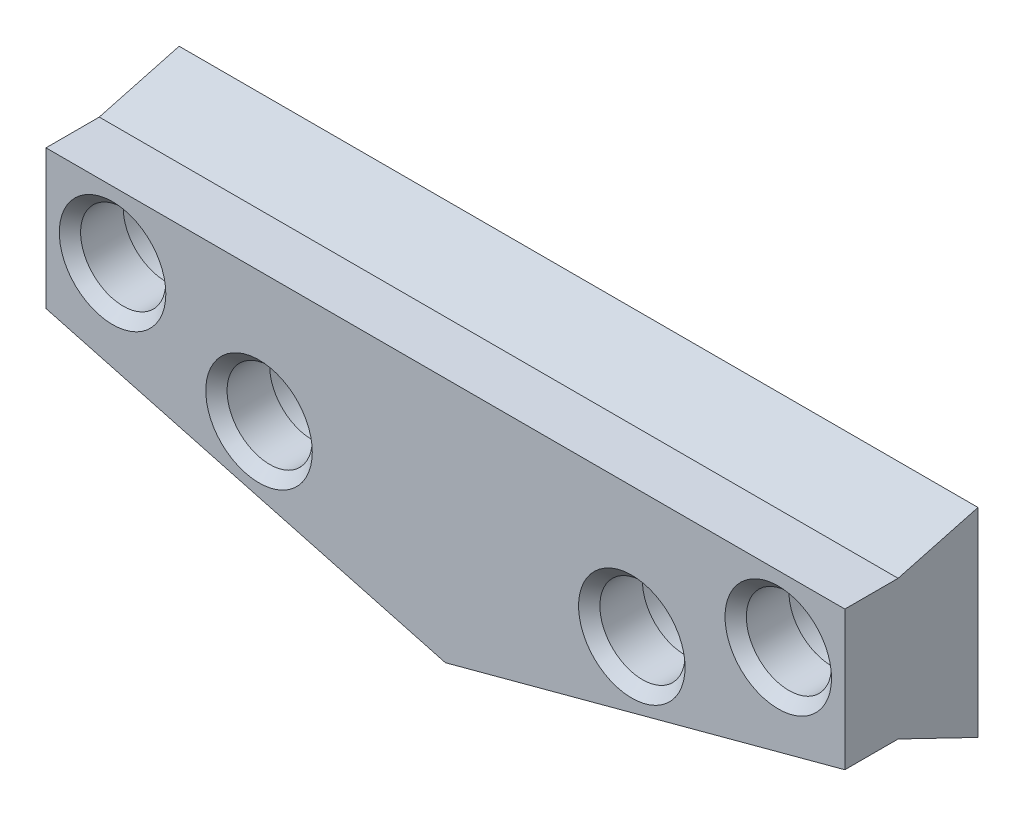
ISO-10303-21;
HEADER;
FILE_DESCRIPTION(('STEP AP214'),'2;1');
FILE_NAME('part.step','',(''),(''),'','','');
FILE_SCHEMA(('AUTOMOTIVE_DESIGN { 1 0 10303 214 1 1 1 1 }'));
ENDSEC;
DATA;
#1=APPLICATION_CONTEXT('core data for automotive mechanical design processes');
#2=APPLICATION_PROTOCOL_DEFINITION('international standard','automotive_design',2000,#1);
#3=PRODUCT_CONTEXT('',#1,'mechanical');
#4=PRODUCT('Part','Part','',(#3));
#5=PRODUCT_RELATED_PRODUCT_CATEGORY('part','',(#4));
#6=PRODUCT_DEFINITION_FORMATION('','',#4);
#7=PRODUCT_DEFINITION_CONTEXT('part definition',#1,'design');
#8=PRODUCT_DEFINITION('design','',#6,#7);
#9=PRODUCT_DEFINITION_SHAPE('','',#8);
#10=(LENGTH_UNIT() NAMED_UNIT(*) SI_UNIT(.MILLI.,.METRE.));
#11=(NAMED_UNIT(*) PLANE_ANGLE_UNIT() SI_UNIT($,.RADIAN.));
#12=(NAMED_UNIT(*) SI_UNIT($,.STERADIAN.) SOLID_ANGLE_UNIT());
#13=UNCERTAINTY_MEASURE_WITH_UNIT(LENGTH_MEASURE(1.E-05),#10,'distance_accuracy_value','');
#14=(GEOMETRIC_REPRESENTATION_CONTEXT(3) GLOBAL_UNCERTAINTY_ASSIGNED_CONTEXT((#13)) GLOBAL_UNIT_ASSIGNED_CONTEXT((#10,
#11,#12)) REPRESENTATION_CONTEXT('',''));
#15=CARTESIAN_POINT('',(0.,0.,0.));
#16=DIRECTION('',(0.,0.,1.));
#17=DIRECTION('',(1.,0.,0.));
#18=AXIS2_PLACEMENT_3D('',#15,#16,#17);
#19=CARTESIAN_POINT('',(-15.,13.,3.));
#20=DIRECTION('',(1.,0.,0.));
#21=DIRECTION('',(0.,1.,0.));
#22=AXIS2_PLACEMENT_3D('',#19,#20,#21);
#23=PLANE('',#22);
#24=DIRECTION('',(0.,0.43474803644423,0.900552133309275));
#25=VECTOR('',#24,1.);
#26=CARTESIAN_POINT('',(-15.,5.64280352376925,1.3631100676125));
#27=LINE('',#26,#25);
#28=CARTESIAN_POINT('',(-15.,4.98475230892817,0.));
#29=VERTEX_POINT('',#28);
#30=CARTESIAN_POINT('',(-15.,6.43302394262023,3.));
#31=VERTEX_POINT('',#30);
#32=EDGE_CURVE('E230',#29,#31,#27,.T.);
#33=ORIENTED_EDGE('',*,*,#32,.T.);
#34=DIRECTION('',(0.,0.,-1.));
#35=VECTOR('',#34,1.);
#36=CARTESIAN_POINT('',(-15.,6.43302394262023,5.));
#37=LINE('',#36,#35);
#38=CARTESIAN_POINT('',(-15.,6.43302394262023,5.));
#39=VERTEX_POINT('',#38);
#40=EDGE_CURVE('E202',#39,#31,#37,.T.);
#41=ORIENTED_EDGE('',*,*,#40,.F.);
#42=DIRECTION('',(0.,-1.,0.));
#43=VECTOR('',#42,1.);
#44=CARTESIAN_POINT('',(-15.,0.,5.));
#45=LINE('',#44,#43);
#46=CARTESIAN_POINT('',(-15.,11.6602540378443,5.));
#47=VERTEX_POINT('',#46);
#48=EDGE_CURVE('E195',#47,#39,#45,.T.);
#49=ORIENTED_EDGE('',*,*,#48,.F.);
#50=DIRECTION('',(0.,0.,-1.));
#51=VECTOR('',#50,1.);
#52=CARTESIAN_POINT('',(-15.,11.6602540378443,5.));
#53=LINE('',#52,#51);
#54=CARTESIAN_POINT('',(-15.,11.6602540378443,3.));
#55=VERTEX_POINT('',#54);
#56=EDGE_CURVE('E205',#47,#55,#53,.T.);
#57=ORIENTED_EDGE('',*,*,#56,.T.);
#58=DIRECTION('',(0.,0.258819045102528,-0.965925826289067));
#59=VECTOR('',#58,1.);
#60=CARTESIAN_POINT('',(-15.,11.6602540378443,3.));
#61=LINE('',#60,#59);
#62=CARTESIAN_POINT('',(-15.,12.4641016151377,0.));
#63=VERTEX_POINT('',#62);
#64=EDGE_CURVE('E238',#55,#63,#61,.T.);
#65=ORIENTED_EDGE('',*,*,#64,.T.);
#66=DIRECTION('',(0.,-1.,0.));
#67=VECTOR('',#66,1.);
#68=CARTESIAN_POINT('',(-15.,13.,0.));
#69=LINE('',#68,#67);
#70=EDGE_CURVE('E215',#63,#29,#69,.T.);
#71=ORIENTED_EDGE('',*,*,#70,.T.);
#72=EDGE_LOOP('',(#33,#41,#49,#57,#65,#71));
#73=FACE_BOUND('',#72,.T.);
#74=ADVANCED_FACE('F35',(#73),#23,.F.);
#75=CARTESIAN_POINT('',(15.,13.,3.));
#76=DIRECTION('',(-1.,0.,0.));
#77=DIRECTION('',(0.,-1.,0.));
#78=AXIS2_PLACEMENT_3D('',#75,#76,#77);
#79=PLANE('',#78);
#80=DIRECTION('',(0.,1.,0.));
#81=VECTOR('',#80,1.);
#82=CARTESIAN_POINT('',(15.,13.,0.));
#83=LINE('',#82,#81);
#84=CARTESIAN_POINT('',(15.,4.98475230892817,0.));
#85=VERTEX_POINT('',#84);
#86=CARTESIAN_POINT('',(15.,12.4641016151377,0.));
#87=VERTEX_POINT('',#86);
#88=EDGE_CURVE('E217',#85,#87,#83,.T.);
#89=ORIENTED_EDGE('',*,*,#88,.T.);
#90=DIRECTION('',(0.,-0.258819045102528,0.965925826289067));
#91=VECTOR('',#90,1.);
#92=CARTESIAN_POINT('',(15.,11.6602540378443,3.));
#93=LINE('',#92,#91);
#94=CARTESIAN_POINT('',(15.,11.6602540378443,3.));
#95=VERTEX_POINT('',#94);
#96=EDGE_CURVE('E241',#87,#95,#93,.T.);
#97=ORIENTED_EDGE('',*,*,#96,.T.);
#98=DIRECTION('',(0.,0.,-1.));
#99=VECTOR('',#98,1.);
#100=CARTESIAN_POINT('',(15.,11.6602540378443,5.));
#101=LINE('',#100,#99);
#102=CARTESIAN_POINT('',(15.,11.6602540378443,5.));
#103=VERTEX_POINT('',#102);
#104=EDGE_CURVE('E208',#103,#95,#101,.T.);
#105=ORIENTED_EDGE('',*,*,#104,.F.);
#106=DIRECTION('',(0.,1.,0.));
#107=VECTOR('',#106,1.);
#108=CARTESIAN_POINT('',(15.,0.,5.));
#109=LINE('',#108,#107);
#110=CARTESIAN_POINT('',(15.,6.43302394262023,5.));
#111=VERTEX_POINT('',#110);
#112=EDGE_CURVE('E190',#111,#103,#109,.T.);
#113=ORIENTED_EDGE('',*,*,#112,.F.);
#114=DIRECTION('',(0.,0.,-1.));
#115=VECTOR('',#114,1.);
#116=CARTESIAN_POINT('',(15.,6.43302394262023,5.));
#117=LINE('',#116,#115);
#118=CARTESIAN_POINT('',(15.,6.43302394262023,3.));
#119=VERTEX_POINT('',#118);
#120=EDGE_CURVE('E211',#111,#119,#117,.T.);
#121=ORIENTED_EDGE('',*,*,#120,.T.);
#122=DIRECTION('',(0.,-0.43474803644423,-0.900552133309275));
#123=VECTOR('',#122,1.);
#124=CARTESIAN_POINT('',(15.,5.64280352376925,1.3631100676125));
#125=LINE('',#124,#123);
#126=EDGE_CURVE('E232',#119,#85,#125,.T.);
#127=ORIENTED_EDGE('',*,*,#126,.T.);
#128=EDGE_LOOP('',(#89,#97,#105,#113,#121,#127));
#129=FACE_BOUND('',#128,.T.);
#130=ADVANCED_FACE('F291',(#129),#79,.F.);
#131=CARTESIAN_POINT('',(0.,0.,0.));
#132=DIRECTION('',(0.,0.,1.));
#133=DIRECTION('',(1.,0.,0.));
#134=AXIS2_PLACEMENT_3D('',#131,#132,#133);
#135=PLANE('',#134);
#136=DIRECTION('',(1.,0.,0.));
#137=VECTOR('',#136,1.);
#138=CARTESIAN_POINT('',(2.8,10.,0.));
#139=LINE('',#138,#137);
#140=CARTESIAN_POINT('',(-2.8,10.,0.));
#141=VERTEX_POINT('',#140);
#142=CARTESIAN_POINT('',(2.8,10.,0.));
#143=VERTEX_POINT('',#142);
#144=EDGE_CURVE('E153',#141,#143,#139,.T.);
#145=ORIENTED_EDGE('',*,*,#144,.F.);
#146=DIRECTION('',(0.,1.,0.));
#147=VECTOR('',#146,1.);
#148=CARTESIAN_POINT('',(-2.8,10.,0.));
#149=LINE('',#148,#147);
#150=CARTESIAN_POINT('',(-2.8,4.,0.));
#151=VERTEX_POINT('',#150);
#152=EDGE_CURVE('E51',#151,#141,#149,.T.);
#153=ORIENTED_EDGE('',*,*,#152,.F.);
#154=DIRECTION('',(-1.,0.,0.));
#155=VECTOR('',#154,1.);
#156=CARTESIAN_POINT('',(2.8,4.,0.));
#157=LINE('',#156,#155);
#158=CARTESIAN_POINT('',(2.8,4.,0.));
#159=VERTEX_POINT('',#158);
#160=EDGE_CURVE('E144',#159,#151,#157,.T.);
#161=ORIENTED_EDGE('',*,*,#160,.F.);
#162=DIRECTION('',(0.,-1.,0.));
#163=VECTOR('',#162,1.);
#164=CARTESIAN_POINT('',(2.8,10.,0.));
#165=LINE('',#164,#163);
#166=EDGE_CURVE('E147',#143,#159,#165,.T.);
#167=ORIENTED_EDGE('',*,*,#166,.F.);
#168=EDGE_LOOP('',(#145,#153,#161,#167));
#169=FACE_BOUND('',#168,.T.);
#170=CARTESIAN_POINT('',(12.5,9.16025403784434,0.));
#171=DIRECTION('',(0.,0.,1.));
#172=DIRECTION('',(1.,0.,0.));
#173=AXIS2_PLACEMENT_3D('',#170,#171,#172);
#174=CIRCLE('',#173,2.);
#175=CARTESIAN_POINT('',(14.5,9.16025403784434,0.));
#176=VERTEX_POINT('',#175);
#177=EDGE_CURVE('E159',#176,#176,#174,.T.);
#178=ORIENTED_EDGE('',*,*,#177,.T.);
#179=EDGE_LOOP('',(#178));
#180=FACE_BOUND('',#179,.T.);
#181=CARTESIAN_POINT('',(-7.,6.76233827618798,0.));
#182=DIRECTION('',(0.,0.,1.));
#183=DIRECTION('',(1.,0.,0.));
#184=AXIS2_PLACEMENT_3D('',#181,#182,#183);
#185=CIRCLE('',#184,2.);
#186=CARTESIAN_POINT('',(-5.,6.76233827618798,0.));
#187=VERTEX_POINT('',#186);
#188=EDGE_CURVE('E173',#187,#187,#185,.T.);
#189=ORIENTED_EDGE('',*,*,#188,.T.);
#190=EDGE_LOOP('',(#189));
#191=FACE_BOUND('',#190,.T.);
#192=CARTESIAN_POINT('',(-12.5,9.16025403784434,0.));
#193=DIRECTION('',(0.,0.,1.));
#194=DIRECTION('',(1.,0.,0.));
#195=AXIS2_PLACEMENT_3D('',#192,#193,#194);
#196=CIRCLE('',#195,2.);
#197=CARTESIAN_POINT('',(-10.5,9.16025403784434,0.));
#198=VERTEX_POINT('',#197);
#199=EDGE_CURVE('E167',#198,#198,#196,.T.);
#200=ORIENTED_EDGE('',*,*,#199,.T.);
#201=EDGE_LOOP('',(#200));
#202=FACE_BOUND('',#201,.T.);
#203=CARTESIAN_POINT('',(7.,6.76233827618798,0.));
#204=DIRECTION('',(0.,0.,1.));
#205=DIRECTION('',(1.,0.,0.));
#206=AXIS2_PLACEMENT_3D('',#203,#204,#205);
#207=CIRCLE('',#206,2.);
#208=CARTESIAN_POINT('',(9.,6.76233827618798,0.));
#209=VERTEX_POINT('',#208);
#210=EDGE_CURVE('E166',#209,#209,#207,.T.);
#211=ORIENTED_EDGE('',*,*,#210,.T.);
#212=EDGE_LOOP('',(#211));
#213=FACE_BOUND('',#212,.T.);
#214=ORIENTED_EDGE('',*,*,#70,.F.);
#215=DIRECTION('',(1.,0.,0.));
#216=VECTOR('',#215,1.);
#217=CARTESIAN_POINT('',(0.,12.4641016151377,0.));
#218=LINE('',#217,#216);
#219=EDGE_CURVE('E59',#63,#87,#218,.T.);
#220=ORIENTED_EDGE('',*,*,#219,.T.);
#221=ORIENTED_EDGE('',*,*,#88,.F.);
#222=DIRECTION('',(-0.965925826289069,-0.258819045102518,0.));
#223=VECTOR('',#222,1.);
#224=CARTESIAN_POINT('',(-0.241378605615342,0.9008372200166,0.));
#225=LINE('',#224,#223);
#226=CARTESIAN_POINT('',(0.,0.96551442246138,0.));
#227=VERTEX_POINT('',#226);
#228=EDGE_CURVE('E225',#85,#227,#225,.T.);
#229=ORIENTED_EDGE('',*,*,#228,.T.);
#230=DIRECTION('',(-0.965925826289069,0.258819045102518,0.));
#231=VECTOR('',#230,1.);
#232=CARTESIAN_POINT('',(0.241378605615342,0.9008372200166,0.));
#233=LINE('',#232,#231);
#234=EDGE_CURVE('E227',#227,#29,#233,.T.);
#235=ORIENTED_EDGE('',*,*,#234,.T.);
#236=EDGE_LOOP('',(#214,#220,#221,#229,#235));
#237=FACE_BOUND('',#236,.T.);
#238=ADVANCED_FACE('F297',(#169,#180,#191,#202,#213,#237),#135,.F.);
#239=CARTESIAN_POINT('',(-0.603446514038353,2.25209305004149,3.));
#240=DIRECTION('',(0.234569716009801,-0.875426098065591,0.422618261740705));
#241=DIRECTION('',(-0.965925826289069,-0.258819045102518,0.));
#242=AXIS2_PLACEMENT_3D('',#239,#240,#241);
#243=PLANE('',#242);
#244=ORIENTED_EDGE('',*,*,#126,.F.);
#245=DIRECTION('',(0.965925826289069,0.258819045102518,0.));
#246=VECTOR('',#245,1.);
#247=CARTESIAN_POINT('',(14.3965534859616,6.27133093650828,3.));
#248=LINE('',#247,#246);
#249=CARTESIAN_POINT('',(0.,2.41378605615344,3.));
#250=VERTEX_POINT('',#249);
#251=EDGE_CURVE('E219',#250,#119,#248,.T.);
#252=ORIENTED_EDGE('',*,*,#251,.F.);
#253=DIRECTION('',(0.,-0.43474803644423,-0.900552133309275));
#254=VECTOR('',#253,1.);
#255=CARTESIAN_POINT('',(0.,2.38322513125466,2.93669504217065));
#256=LINE('',#255,#254);
#257=EDGE_CURVE('E214',#227,#250,#256,.F.);
#258=ORIENTED_EDGE('',*,*,#257,.F.);
#259=ORIENTED_EDGE('',*,*,#228,.F.);
#260=EDGE_LOOP('',(#244,#252,#258,#259));
#261=FACE_BOUND('',#260,.T.);
#262=ADVANCED_FACE('F311',(#261),#243,.T.);
#263=CARTESIAN_POINT('',(0.603446514038353,2.25209305004149,3.));
#264=DIRECTION('',(-0.234569716009801,-0.875426098065591,0.422618261740705));
#265=DIRECTION('',(-0.965925826289069,0.258819045102518,0.));
#266=AXIS2_PLACEMENT_3D('',#263,#264,#265);
#267=PLANE('',#266);
#268=ORIENTED_EDGE('',*,*,#32,.F.);
#269=ORIENTED_EDGE('',*,*,#234,.F.);
#270=ORIENTED_EDGE('',*,*,#257,.T.);
#271=DIRECTION('',(0.965925826289069,-0.258819045102518,0.));
#272=VECTOR('',#271,1.);
#273=CARTESIAN_POINT('',(0.603446514038353,2.25209305004149,3.));
#274=LINE('',#273,#272);
#275=EDGE_CURVE('E222',#31,#250,#274,.T.);
#276=ORIENTED_EDGE('',*,*,#275,.F.);
#277=EDGE_LOOP('',(#268,#269,#270,#276));
#278=FACE_BOUND('',#277,.T.);
#279=ADVANCED_FACE('F303',(#278),#267,.T.);
#280=CARTESIAN_POINT('',(0.,11.6602540378443,3.));
#281=DIRECTION('',(0.,0.965925826289066,0.258819045102528));
#282=DIRECTION('',(1.,0.,0.));
#283=AXIS2_PLACEMENT_3D('',#280,#281,#282);
#284=PLANE('',#283);
#285=ORIENTED_EDGE('',*,*,#96,.F.);
#286=ORIENTED_EDGE('',*,*,#219,.F.);
#287=ORIENTED_EDGE('',*,*,#64,.F.);
#288=DIRECTION('',(-1.,0.,0.));
#289=VECTOR('',#288,1.);
#290=CARTESIAN_POINT('',(-15.,11.6602540378443,3.));
#291=LINE('',#290,#289);
#292=EDGE_CURVE('E234',#95,#55,#291,.T.);
#293=ORIENTED_EDGE('',*,*,#292,.F.);
#294=EDGE_LOOP('',(#285,#286,#287,#293));
#295=FACE_BOUND('',#294,.T.);
#296=ADVANCED_FACE('F310',(#295),#284,.T.);
#297=CARTESIAN_POINT('',(-0.603446514038353,2.25209305004149,5.));
#298=DIRECTION('',(-0.258819045102518,0.965925826289069,0.));
#299=DIRECTION('',(-0.965925826289069,-0.258819045102518,0.));
#300=AXIS2_PLACEMENT_3D('',#297,#298,#299);
#301=PLANE('',#300);
#302=ORIENTED_EDGE('',*,*,#251,.T.);
#303=ORIENTED_EDGE('',*,*,#120,.F.);
#304=DIRECTION('',(0.965925826289069,0.258819045102518,0.));
#305=VECTOR('',#304,1.);
#306=CARTESIAN_POINT('',(-0.603446514038353,2.25209305004149,5.));
#307=LINE('',#306,#305);
#308=CARTESIAN_POINT('',(0.,2.41378605615344,5.));
#309=VERTEX_POINT('',#308);
#310=EDGE_CURVE('E187',#309,#111,#307,.T.);
#311=ORIENTED_EDGE('',*,*,#310,.F.);
#312=DIRECTION('',(0.,0.,-1.));
#313=VECTOR('',#312,1.);
#314=CARTESIAN_POINT('',(0.,2.41378605615344,5.));
#315=LINE('',#314,#313);
#316=EDGE_CURVE('E199',#309,#250,#315,.T.);
#317=ORIENTED_EDGE('',*,*,#316,.T.);
#318=EDGE_LOOP('',(#302,#303,#311,#317));
#319=FACE_BOUND('',#318,.T.);
#320=ADVANCED_FACE('F323',(#319),#301,.F.);
#321=CARTESIAN_POINT('',(0.,11.6602540378443,5.));
#322=DIRECTION('',(0.,-1.,0.));
#323=DIRECTION('',(0.,0.,-1.));
#324=AXIS2_PLACEMENT_3D('',#321,#322,#323);
#325=PLANE('',#324);
#326=ORIENTED_EDGE('',*,*,#292,.T.);
#327=ORIENTED_EDGE('',*,*,#56,.F.);
#328=DIRECTION('',(-1.,0.,0.));
#329=VECTOR('',#328,1.);
#330=CARTESIAN_POINT('',(0.,11.6602540378443,5.));
#331=LINE('',#330,#329);
#332=EDGE_CURVE('E193',#103,#47,#331,.T.);
#333=ORIENTED_EDGE('',*,*,#332,.F.);
#334=ORIENTED_EDGE('',*,*,#104,.T.);
#335=EDGE_LOOP('',(#326,#327,#333,#334));
#336=FACE_BOUND('',#335,.T.);
#337=ADVANCED_FACE('F394',(#336),#325,.F.);
#338=CARTESIAN_POINT('',(0.603446514038353,2.25209305004149,5.));
#339=DIRECTION('',(0.258819045102518,0.965925826289069,0.));
#340=DIRECTION('',(-0.965925826289069,0.258819045102518,0.));
#341=AXIS2_PLACEMENT_3D('',#338,#339,#340);
#342=PLANE('',#341);
#343=ORIENTED_EDGE('',*,*,#275,.T.);
#344=ORIENTED_EDGE('',*,*,#316,.F.);
#345=DIRECTION('',(0.965925826289069,-0.258819045102518,0.));
#346=VECTOR('',#345,1.);
#347=CARTESIAN_POINT('',(0.603446514038353,2.25209305004149,5.));
#348=LINE('',#347,#346);
#349=EDGE_CURVE('E197',#39,#309,#348,.T.);
#350=ORIENTED_EDGE('',*,*,#349,.F.);
#351=ORIENTED_EDGE('',*,*,#40,.T.);
#352=EDGE_LOOP('',(#343,#344,#350,#351));
#353=FACE_BOUND('',#352,.T.);
#354=ADVANCED_FACE('F387',(#353),#342,.F.);
#355=CARTESIAN_POINT('',(0.,0.,5.));
#356=DIRECTION('',(0.,0.,1.));
#357=DIRECTION('',(1.,0.,0.));
#358=AXIS2_PLACEMENT_3D('',#355,#356,#357);
#359=PLANE('',#358);
#360=CARTESIAN_POINT('',(12.5,9.16025403784434,5.));
#361=DIRECTION('',(0.,0.,1.));
#362=DIRECTION('',(1.,0.,0.));
#363=AXIS2_PLACEMENT_3D('',#360,#361,#362);
#364=CIRCLE('',#363,2.);
#365=CARTESIAN_POINT('',(14.5,9.16025403784434,5.));
#366=VERTEX_POINT('',#365);
#367=EDGE_CURVE('E265',#366,#366,#364,.F.);
#368=ORIENTED_EDGE('',*,*,#367,.T.);
#369=EDGE_LOOP('',(#368));
#370=FACE_BOUND('',#369,.T.);
#371=CARTESIAN_POINT('',(7.,6.76233827618798,5.));
#372=DIRECTION('',(0.,0.,1.));
#373=DIRECTION('',(1.,0.,0.));
#374=AXIS2_PLACEMENT_3D('',#371,#372,#373);
#375=CIRCLE('',#374,2.00000000000001);
#376=CARTESIAN_POINT('',(9.00000000000001,6.76233827618798,5.));
#377=VERTEX_POINT('',#376);
#378=EDGE_CURVE('E262',#377,#377,#375,.F.);
#379=ORIENTED_EDGE('',*,*,#378,.T.);
#380=EDGE_LOOP('',(#379));
#381=FACE_BOUND('',#380,.T.);
#382=CARTESIAN_POINT('',(-7.,6.76233827618798,5.));
#383=DIRECTION('',(0.,0.,1.));
#384=DIRECTION('',(1.,0.,0.));
#385=AXIS2_PLACEMENT_3D('',#382,#383,#384);
#386=CIRCLE('',#385,2.);
#387=CARTESIAN_POINT('',(-5.,6.76233827618798,5.));
#388=VERTEX_POINT('',#387);
#389=EDGE_CURVE('E259',#388,#388,#386,.F.);
#390=ORIENTED_EDGE('',*,*,#389,.T.);
#391=EDGE_LOOP('',(#390));
#392=FACE_BOUND('',#391,.T.);
#393=CARTESIAN_POINT('',(-12.5,9.16025403784434,5.));
#394=DIRECTION('',(0.,0.,1.));
#395=DIRECTION('',(1.,0.,0.));
#396=AXIS2_PLACEMENT_3D('',#393,#394,#395);
#397=CIRCLE('',#396,2.);
#398=CARTESIAN_POINT('',(-10.5,9.16025403784434,5.));
#399=VERTEX_POINT('',#398);
#400=EDGE_CURVE('E256',#399,#399,#397,.F.);
#401=ORIENTED_EDGE('',*,*,#400,.T.);
#402=EDGE_LOOP('',(#401));
#403=FACE_BOUND('',#402,.T.);
#404=ORIENTED_EDGE('',*,*,#310,.T.);
#405=ORIENTED_EDGE('',*,*,#112,.T.);
#406=ORIENTED_EDGE('',*,*,#332,.T.);
#407=ORIENTED_EDGE('',*,*,#48,.T.);
#408=ORIENTED_EDGE('',*,*,#349,.T.);
#409=EDGE_LOOP('',(#404,#405,#406,#407,#408));
#410=FACE_BOUND('',#409,.T.);
#411=ADVANCED_FACE('F390',(#370,#381,#392,#403,#410),#359,.T.);
#412=CARTESIAN_POINT('',(-7.,6.76233827618798,5.));
#413=DIRECTION('',(0.,0.,-1.));
#414=DIRECTION('',(-1.,0.,0.));
#415=AXIS2_PLACEMENT_3D('',#412,#413,#414);
#416=CYLINDRICAL_SURFACE('',#415,1.6);
#417=CARTESIAN_POINT('',(-7.,6.76233827618798,4.6));
#418=DIRECTION('',(0.,0.,1.));
#419=DIRECTION('',(1.,0.,0.));
#420=AXIS2_PLACEMENT_3D('',#417,#418,#419);
#421=CIRCLE('',#420,1.6);
#422=CARTESIAN_POINT('',(-5.4,6.76233827618798,4.6));
#423=VERTEX_POINT('',#422);
#424=EDGE_CURVE('E44',#423,#423,#421,.T.);
#425=ORIENTED_EDGE('',*,*,#424,.T.);
#426=EDGE_LOOP('',(#425));
#427=FACE_BOUND('',#426,.T.);
#428=CARTESIAN_POINT('',(-7.,6.76233827618798,3.));
#429=DIRECTION('',(0.,0.,1.));
#430=DIRECTION('',(1.,0.,0.));
#431=AXIS2_PLACEMENT_3D('',#428,#429,#430);
#432=CIRCLE('',#431,1.6);
#433=CARTESIAN_POINT('',(-5.4,6.76233827618798,3.));
#434=VERTEX_POINT('',#433);
#435=EDGE_CURVE('E191',#434,#434,#432,.T.);
#436=ORIENTED_EDGE('',*,*,#435,.F.);
#437=EDGE_LOOP('',(#436));
#438=FACE_BOUND('',#437,.T.);
#439=ADVANCED_FACE('F273',(#427,#438),#416,.F.);
#440=CARTESIAN_POINT('',(7.,6.76233827618798,5.));
#441=DIRECTION('',(0.,0.,-1.));
#442=DIRECTION('',(-1.,0.,0.));
#443=AXIS2_PLACEMENT_3D('',#440,#441,#442);
#444=CYLINDRICAL_SURFACE('',#443,1.6);
#445=CARTESIAN_POINT('',(7.,6.76233827618798,4.59999999999999));
#446=DIRECTION('',(0.,0.,1.));
#447=DIRECTION('',(1.,0.,0.));
#448=AXIS2_PLACEMENT_3D('',#445,#446,#447);
#449=CIRCLE('',#448,1.6);
#450=CARTESIAN_POINT('',(8.6,6.76233827618798,4.59999999999999));
#451=VERTEX_POINT('',#450);
#452=EDGE_CURVE('E268',#451,#451,#449,.T.);
#453=ORIENTED_EDGE('',*,*,#452,.T.);
#454=EDGE_LOOP('',(#453));
#455=FACE_BOUND('',#454,.T.);
#456=CARTESIAN_POINT('',(7.,6.76233827618798,3.));
#457=DIRECTION('',(0.,0.,1.));
#458=DIRECTION('',(1.,0.,0.));
#459=AXIS2_PLACEMENT_3D('',#456,#457,#458);
#460=CIRCLE('',#459,1.6);
#461=CARTESIAN_POINT('',(8.6,6.76233827618798,3.));
#462=VERTEX_POINT('',#461);
#463=EDGE_CURVE('E249',#462,#462,#460,.T.);
#464=ORIENTED_EDGE('',*,*,#463,.F.);
#465=EDGE_LOOP('',(#464));
#466=FACE_BOUND('',#465,.T.);
#467=ADVANCED_FACE('F409',(#455,#466),#444,.F.);
#468=CARTESIAN_POINT('',(-12.5,9.16025403784434,5.));
#469=DIRECTION('',(0.,0.,-1.));
#470=DIRECTION('',(-1.,0.,0.));
#471=AXIS2_PLACEMENT_3D('',#468,#469,#470);
#472=CYLINDRICAL_SURFACE('',#471,1.6);
#473=CARTESIAN_POINT('',(-12.5,9.16025403784434,4.60000000000001));
#474=DIRECTION('',(0.,0.,1.));
#475=DIRECTION('',(1.,0.,0.));
#476=AXIS2_PLACEMENT_3D('',#473,#474,#475);
#477=CIRCLE('',#476,1.6);
#478=CARTESIAN_POINT('',(-10.9,9.16025403784434,4.60000000000001));
#479=VERTEX_POINT('',#478);
#480=EDGE_CURVE('E11',#479,#479,#477,.T.);
#481=ORIENTED_EDGE('',*,*,#480,.T.);
#482=EDGE_LOOP('',(#481));
#483=FACE_BOUND('',#482,.T.);
#484=CARTESIAN_POINT('',(-12.5,9.16025403784434,3.));
#485=DIRECTION('',(0.,0.,1.));
#486=DIRECTION('',(1.,0.,0.));
#487=AXIS2_PLACEMENT_3D('',#484,#485,#486);
#488=CIRCLE('',#487,1.6);
#489=CARTESIAN_POINT('',(-10.9,9.16025403784434,3.));
#490=VERTEX_POINT('',#489);
#491=EDGE_CURVE('E246',#490,#490,#488,.T.);
#492=ORIENTED_EDGE('',*,*,#491,.F.);
#493=EDGE_LOOP('',(#492));
#494=FACE_BOUND('',#493,.T.);
#495=ADVANCED_FACE('F348',(#483,#494),#472,.F.);
#496=CARTESIAN_POINT('',(12.5,9.16025403784434,5.));
#497=DIRECTION('',(0.,0.,-1.));
#498=DIRECTION('',(-1.,0.,0.));
#499=AXIS2_PLACEMENT_3D('',#496,#497,#498);
#500=CYLINDRICAL_SURFACE('',#499,1.6);
#501=CARTESIAN_POINT('',(12.5,9.16025403784434,4.60000000000001));
#502=DIRECTION('',(0.,0.,1.));
#503=DIRECTION('',(1.,0.,0.));
#504=AXIS2_PLACEMENT_3D('',#501,#502,#503);
#505=CIRCLE('',#504,1.6);
#506=CARTESIAN_POINT('',(14.1,9.16025403784434,4.60000000000001));
#507=VERTEX_POINT('',#506);
#508=EDGE_CURVE('E243',#507,#507,#505,.T.);
#509=ORIENTED_EDGE('',*,*,#508,.T.);
#510=EDGE_LOOP('',(#509));
#511=FACE_BOUND('',#510,.T.);
#512=CARTESIAN_POINT('',(12.5,9.16025403784434,3.));
#513=DIRECTION('',(0.,0.,1.));
#514=DIRECTION('',(1.,0.,0.));
#515=AXIS2_PLACEMENT_3D('',#512,#513,#514);
#516=CIRCLE('',#515,1.6);
#517=CARTESIAN_POINT('',(14.1,9.16025403784434,3.));
#518=VERTEX_POINT('',#517);
#519=EDGE_CURVE('E184',#518,#518,#516,.T.);
#520=ORIENTED_EDGE('',*,*,#519,.F.);
#521=EDGE_LOOP('',(#520));
#522=FACE_BOUND('',#521,.T.);
#523=ADVANCED_FACE('F344',(#511,#522),#500,.F.);
#524=CARTESIAN_POINT('',(12.5,9.16025403784434,3.));
#525=DIRECTION('',(0.,0.,-1.));
#526=DIRECTION('',(-1.,0.,0.));
#527=AXIS2_PLACEMENT_3D('',#524,#525,#526);
#528=CYLINDRICAL_SURFACE('',#527,2.);
#529=CARTESIAN_POINT('',(12.5,9.16025403784434,3.));
#530=DIRECTION('',(0.,0.,1.));
#531=DIRECTION('',(1.,0.,0.));
#532=AXIS2_PLACEMENT_3D('',#529,#530,#531);
#533=CIRCLE('',#532,2.);
#534=CARTESIAN_POINT('',(14.5,9.16025403784434,3.));
#535=VERTEX_POINT('',#534);
#536=EDGE_CURVE('E176',#535,#535,#533,.T.);
#537=ORIENTED_EDGE('',*,*,#536,.T.);
#538=EDGE_LOOP('',(#537));
#539=FACE_BOUND('',#538,.T.);
#540=ORIENTED_EDGE('',*,*,#177,.F.);
#541=EDGE_LOOP('',(#540));
#542=FACE_BOUND('',#541,.T.);
#543=ADVANCED_FACE('F347',(#539,#542),#528,.F.);
#544=CARTESIAN_POINT('',(12.5,9.16025403784434,3.));
#545=DIRECTION('',(0.,0.,1.));
#546=DIRECTION('',(1.,0.,0.));
#547=AXIS2_PLACEMENT_3D('',#544,#545,#546);
#548=PLANE('',#547);
#549=ORIENTED_EDGE('',*,*,#519,.T.);
#550=EDGE_LOOP('',(#549));
#551=FACE_BOUND('',#550,.T.);
#552=ORIENTED_EDGE('',*,*,#536,.F.);
#553=EDGE_LOOP('',(#552));
#554=FACE_BOUND('',#553,.T.);
#555=ADVANCED_FACE('F352',(#551,#554),#548,.F.);
#556=CARTESIAN_POINT('',(-12.5,9.16025403784434,3.));
#557=DIRECTION('',(0.,0.,-1.));
#558=DIRECTION('',(-1.,0.,0.));
#559=AXIS2_PLACEMENT_3D('',#556,#557,#558);
#560=CYLINDRICAL_SURFACE('',#559,2.);
#561=CARTESIAN_POINT('',(-12.5,9.16025403784434,3.));
#562=DIRECTION('',(0.,0.,1.));
#563=DIRECTION('',(1.,0.,0.));
#564=AXIS2_PLACEMENT_3D('',#561,#562,#563);
#565=CIRCLE('',#564,2.);
#566=CARTESIAN_POINT('',(-10.5,9.16025403784434,3.));
#567=VERTEX_POINT('',#566);
#568=EDGE_CURVE('E163',#567,#567,#565,.T.);
#569=ORIENTED_EDGE('',*,*,#568,.T.);
#570=EDGE_LOOP('',(#569));
#571=FACE_BOUND('',#570,.T.);
#572=ORIENTED_EDGE('',*,*,#199,.F.);
#573=EDGE_LOOP('',(#572));
#574=FACE_BOUND('',#573,.T.);
#575=ADVANCED_FACE('F355',(#571,#574),#560,.F.);
#576=CARTESIAN_POINT('',(-12.5,9.16025403784434,3.));
#577=DIRECTION('',(0.,0.,1.));
#578=DIRECTION('',(1.,0.,0.));
#579=AXIS2_PLACEMENT_3D('',#576,#577,#578);
#580=PLANE('',#579);
#581=ORIENTED_EDGE('',*,*,#491,.T.);
#582=EDGE_LOOP('',(#581));
#583=FACE_BOUND('',#582,.T.);
#584=ORIENTED_EDGE('',*,*,#568,.F.);
#585=EDGE_LOOP('',(#584));
#586=FACE_BOUND('',#585,.T.);
#587=ADVANCED_FACE('F421',(#583,#586),#580,.F.);
#588=CARTESIAN_POINT('',(7.,6.76233827618798,3.));
#589=DIRECTION('',(0.,0.,-1.));
#590=DIRECTION('',(-1.,0.,0.));
#591=AXIS2_PLACEMENT_3D('',#588,#589,#590);
#592=CYLINDRICAL_SURFACE('',#591,2.);
#593=CARTESIAN_POINT('',(7.,6.76233827618798,3.));
#594=DIRECTION('',(0.,0.,1.));
#595=DIRECTION('',(1.,0.,0.));
#596=AXIS2_PLACEMENT_3D('',#593,#594,#595);
#597=CIRCLE('',#596,2.);
#598=CARTESIAN_POINT('',(9.,6.76233827618798,3.));
#599=VERTEX_POINT('',#598);
#600=EDGE_CURVE('E181',#599,#599,#597,.T.);
#601=ORIENTED_EDGE('',*,*,#600,.T.);
#602=EDGE_LOOP('',(#601));
#603=FACE_BOUND('',#602,.T.);
#604=ORIENTED_EDGE('',*,*,#210,.F.);
#605=EDGE_LOOP('',(#604));
#606=FACE_BOUND('',#605,.T.);
#607=ADVANCED_FACE('F417',(#603,#606),#592,.F.);
#608=CARTESIAN_POINT('',(7.,6.76233827618798,3.));
#609=DIRECTION('',(0.,0.,1.));
#610=DIRECTION('',(1.,0.,0.));
#611=AXIS2_PLACEMENT_3D('',#608,#609,#610);
#612=PLANE('',#611);
#613=ORIENTED_EDGE('',*,*,#463,.T.);
#614=EDGE_LOOP('',(#613));
#615=FACE_BOUND('',#614,.T.);
#616=ORIENTED_EDGE('',*,*,#600,.F.);
#617=EDGE_LOOP('',(#616));
#618=FACE_BOUND('',#617,.T.);
#619=ADVANCED_FACE('F420',(#615,#618),#612,.F.);
#620=CARTESIAN_POINT('',(-7.,6.76233827618798,3.));
#621=DIRECTION('',(0.,0.,-1.));
#622=DIRECTION('',(-1.,0.,0.));
#623=AXIS2_PLACEMENT_3D('',#620,#621,#622);
#624=CYLINDRICAL_SURFACE('',#623,2.);
#625=CARTESIAN_POINT('',(-7.,6.76233827618798,3.));
#626=DIRECTION('',(0.,0.,1.));
#627=DIRECTION('',(1.,0.,0.));
#628=AXIS2_PLACEMENT_3D('',#625,#626,#627);
#629=CIRCLE('',#628,2.);
#630=CARTESIAN_POINT('',(-5.,6.76233827618798,3.));
#631=VERTEX_POINT('',#630);
#632=EDGE_CURVE('E170',#631,#631,#629,.T.);
#633=ORIENTED_EDGE('',*,*,#632,.T.);
#634=EDGE_LOOP('',(#633));
#635=FACE_BOUND('',#634,.T.);
#636=ORIENTED_EDGE('',*,*,#188,.F.);
#637=EDGE_LOOP('',(#636));
#638=FACE_BOUND('',#637,.T.);
#639=ADVANCED_FACE('F424',(#635,#638),#624,.F.);
#640=CARTESIAN_POINT('',(-7.,6.76233827618798,3.));
#641=DIRECTION('',(0.,0.,1.));
#642=DIRECTION('',(1.,0.,0.));
#643=AXIS2_PLACEMENT_3D('',#640,#641,#642);
#644=PLANE('',#643);
#645=ORIENTED_EDGE('',*,*,#435,.T.);
#646=EDGE_LOOP('',(#645));
#647=FACE_BOUND('',#646,.T.);
#648=ORIENTED_EDGE('',*,*,#632,.F.);
#649=EDGE_LOOP('',(#648));
#650=FACE_BOUND('',#649,.T.);
#651=ADVANCED_FACE('F429',(#647,#650),#644,.F.);
#652=CARTESIAN_POINT('',(-2.8,10.,2.));
#653=DIRECTION('',(-1.,0.,0.));
#654=DIRECTION('',(0.,-1.,0.));
#655=AXIS2_PLACEMENT_3D('',#652,#653,#654);
#656=PLANE('',#655);
#657=ORIENTED_EDGE('',*,*,#152,.T.);
#658=DIRECTION('',(0.,0.,-1.));
#659=VECTOR('',#658,1.);
#660=CARTESIAN_POINT('',(-2.8,10.,2.));
#661=LINE('',#660,#659);
#662=CARTESIAN_POINT('',(-2.8,10.,2.));
#663=VERTEX_POINT('',#662);
#664=EDGE_CURVE('E122',#663,#141,#661,.T.);
#665=ORIENTED_EDGE('',*,*,#664,.F.);
#666=DIRECTION('',(0.,1.,0.));
#667=VECTOR('',#666,1.);
#668=CARTESIAN_POINT('',(-2.8,10.,2.));
#669=LINE('',#668,#667);
#670=CARTESIAN_POINT('',(-2.8,4.,2.));
#671=VERTEX_POINT('',#670);
#672=EDGE_CURVE('E126',#671,#663,#669,.T.);
#673=ORIENTED_EDGE('',*,*,#672,.F.);
#674=DIRECTION('',(0.,0.,-1.));
#675=VECTOR('',#674,1.);
#676=CARTESIAN_POINT('',(-2.8,4.,2.));
#677=LINE('',#676,#675);
#678=EDGE_CURVE('E157',#671,#151,#677,.T.);
#679=ORIENTED_EDGE('',*,*,#678,.T.);
#680=EDGE_LOOP('',(#657,#665,#673,#679));
#681=FACE_BOUND('',#680,.T.);
#682=ADVANCED_FACE('F124',(#681),#656,.F.);
#683=CARTESIAN_POINT('',(2.8,4.,2.));
#684=DIRECTION('',(0.,-1.,0.));
#685=DIRECTION('',(0.,0.,-1.));
#686=AXIS2_PLACEMENT_3D('',#683,#684,#685);
#687=PLANE('',#686);
#688=ORIENTED_EDGE('',*,*,#160,.T.);
#689=ORIENTED_EDGE('',*,*,#678,.F.);
#690=DIRECTION('',(-1.,0.,0.));
#691=VECTOR('',#690,1.);
#692=CARTESIAN_POINT('',(2.8,4.,2.));
#693=LINE('',#692,#691);
#694=CARTESIAN_POINT('',(2.8,4.,2.));
#695=VERTEX_POINT('',#694);
#696=EDGE_CURVE('E132',#695,#671,#693,.T.);
#697=ORIENTED_EDGE('',*,*,#696,.F.);
#698=DIRECTION('',(0.,0.,-1.));
#699=VECTOR('',#698,1.);
#700=CARTESIAN_POINT('',(2.8,4.,2.));
#701=LINE('',#700,#699);
#702=EDGE_CURVE('E160',#695,#159,#701,.T.);
#703=ORIENTED_EDGE('',*,*,#702,.T.);
#704=EDGE_LOOP('',(#688,#689,#697,#703));
#705=FACE_BOUND('',#704,.T.);
#706=ADVANCED_FACE('F442',(#705),#687,.F.);
#707=CARTESIAN_POINT('',(2.8,10.,2.));
#708=DIRECTION('',(1.,0.,0.));
#709=DIRECTION('',(0.,1.,0.));
#710=AXIS2_PLACEMENT_3D('',#707,#708,#709);
#711=PLANE('',#710);
#712=ORIENTED_EDGE('',*,*,#166,.T.);
#713=ORIENTED_EDGE('',*,*,#702,.F.);
#714=DIRECTION('',(0.,-1.,0.));
#715=VECTOR('',#714,1.);
#716=CARTESIAN_POINT('',(2.8,10.,2.));
#717=LINE('',#716,#715);
#718=CARTESIAN_POINT('',(2.8,10.,2.));
#719=VERTEX_POINT('',#718);
#720=EDGE_CURVE('E140',#719,#695,#717,.T.);
#721=ORIENTED_EDGE('',*,*,#720,.F.);
#722=DIRECTION('',(0.,0.,-1.));
#723=VECTOR('',#722,1.);
#724=CARTESIAN_POINT('',(2.8,10.,2.));
#725=LINE('',#724,#723);
#726=EDGE_CURVE('E131',#719,#143,#725,.T.);
#727=ORIENTED_EDGE('',*,*,#726,.T.);
#728=EDGE_LOOP('',(#712,#713,#721,#727));
#729=FACE_BOUND('',#728,.T.);
#730=ADVANCED_FACE('F445',(#729),#711,.F.);
#731=CARTESIAN_POINT('',(2.8,10.,2.));
#732=DIRECTION('',(0.,1.,0.));
#733=DIRECTION('',(0.,0.,1.));
#734=AXIS2_PLACEMENT_3D('',#731,#732,#733);
#735=PLANE('',#734);
#736=ORIENTED_EDGE('',*,*,#144,.T.);
#737=ORIENTED_EDGE('',*,*,#726,.F.);
#738=DIRECTION('',(1.,0.,0.));
#739=VECTOR('',#738,1.);
#740=CARTESIAN_POINT('',(2.8,10.,2.));
#741=LINE('',#740,#739);
#742=EDGE_CURVE('E135',#663,#719,#741,.T.);
#743=ORIENTED_EDGE('',*,*,#742,.F.);
#744=ORIENTED_EDGE('',*,*,#664,.T.);
#745=EDGE_LOOP('',(#736,#737,#743,#744));
#746=FACE_BOUND('',#745,.T.);
#747=ADVANCED_FACE('F136',(#746),#735,.F.);
#748=CARTESIAN_POINT('',(0.,0.,2.));
#749=DIRECTION('',(0.,0.,-1.));
#750=DIRECTION('',(-1.,0.,0.));
#751=AXIS2_PLACEMENT_3D('',#748,#749,#750);
#752=PLANE('',#751);
#753=ORIENTED_EDGE('',*,*,#672,.T.);
#754=ORIENTED_EDGE('',*,*,#742,.T.);
#755=ORIENTED_EDGE('',*,*,#720,.T.);
#756=ORIENTED_EDGE('',*,*,#696,.T.);
#757=EDGE_LOOP('',(#753,#754,#755,#756));
#758=FACE_BOUND('',#757,.T.);
#759=ADVANCED_FACE('F142',(#758),#752,.T.);
#760=CARTESIAN_POINT('',(12.5,9.16025403784434,4.60000000000001));
#761=DIRECTION('',(0.,0.,1.));
#762=DIRECTION('',(1.,0.,0.));
#763=AXIS2_PLACEMENT_3D('',#760,#761,#762);
#764=CONICAL_SURFACE('',#763,1.6,0.785398163397451);
#765=ORIENTED_EDGE('',*,*,#367,.F.);
#766=EDGE_LOOP('',(#765));
#767=FACE_BOUND('',#766,.T.);
#768=ORIENTED_EDGE('',*,*,#508,.F.);
#769=EDGE_LOOP('',(#768));
#770=FACE_BOUND('',#769,.T.);
#771=ADVANCED_FACE('F285',(#767,#770),#764,.F.);
#772=CARTESIAN_POINT('',(7.,6.76233827618798,4.59999999999999));
#773=DIRECTION('',(0.,0.,1.));
#774=DIRECTION('',(1.,0.,0.));
#775=AXIS2_PLACEMENT_3D('',#772,#773,#774);
#776=CONICAL_SURFACE('',#775,1.6,0.785398163397449);
#777=ORIENTED_EDGE('',*,*,#378,.F.);
#778=EDGE_LOOP('',(#777));
#779=FACE_BOUND('',#778,.T.);
#780=ORIENTED_EDGE('',*,*,#452,.F.);
#781=EDGE_LOOP('',(#780));
#782=FACE_BOUND('',#781,.T.);
#783=ADVANCED_FACE('F278',(#779,#782),#776,.F.);
#784=CARTESIAN_POINT('',(-7.,6.76233827618798,4.6));
#785=DIRECTION('',(0.,0.,1.));
#786=DIRECTION('',(1.,0.,0.));
#787=AXIS2_PLACEMENT_3D('',#784,#785,#786);
#788=CONICAL_SURFACE('',#787,1.6,0.785398163397445);
#789=ORIENTED_EDGE('',*,*,#389,.F.);
#790=EDGE_LOOP('',(#789));
#791=FACE_BOUND('',#790,.T.);
#792=ORIENTED_EDGE('',*,*,#424,.F.);
#793=EDGE_LOOP('',(#792));
#794=FACE_BOUND('',#793,.T.);
#795=ADVANCED_FACE('F276',(#791,#794),#788,.F.);
#796=CARTESIAN_POINT('',(-12.5,9.16025403784434,4.60000000000001));
#797=DIRECTION('',(0.,0.,1.));
#798=DIRECTION('',(1.,0.,0.));
#799=AXIS2_PLACEMENT_3D('',#796,#797,#798);
#800=CONICAL_SURFACE('',#799,1.6,0.785398163397451);
#801=ORIENTED_EDGE('',*,*,#400,.F.);
#802=EDGE_LOOP('',(#801));
#803=FACE_BOUND('',#802,.T.);
#804=ORIENTED_EDGE('',*,*,#480,.F.);
#805=EDGE_LOOP('',(#804));
#806=FACE_BOUND('',#805,.T.);
#807=ADVANCED_FACE('F38',(#803,#806),#800,.F.);
#808=CLOSED_SHELL('',(#74,#130,#238,#262,#279,#296,#320,#337,#354,#411,#439,#467,#495,#523,#543,
#555,#575,#587,#607,#619,#639,#651,#682,#706,#730,#747,#759,#771,#783,#795,#807));
#809=MANIFOLD_SOLID_BREP('B2',#808);
#810=ADVANCED_BREP_SHAPE_REPRESENTATION('',(#18,#809),#14);
#811=SHAPE_DEFINITION_REPRESENTATION(#9,#810);
ENDSEC;
END-ISO-10303-21;
